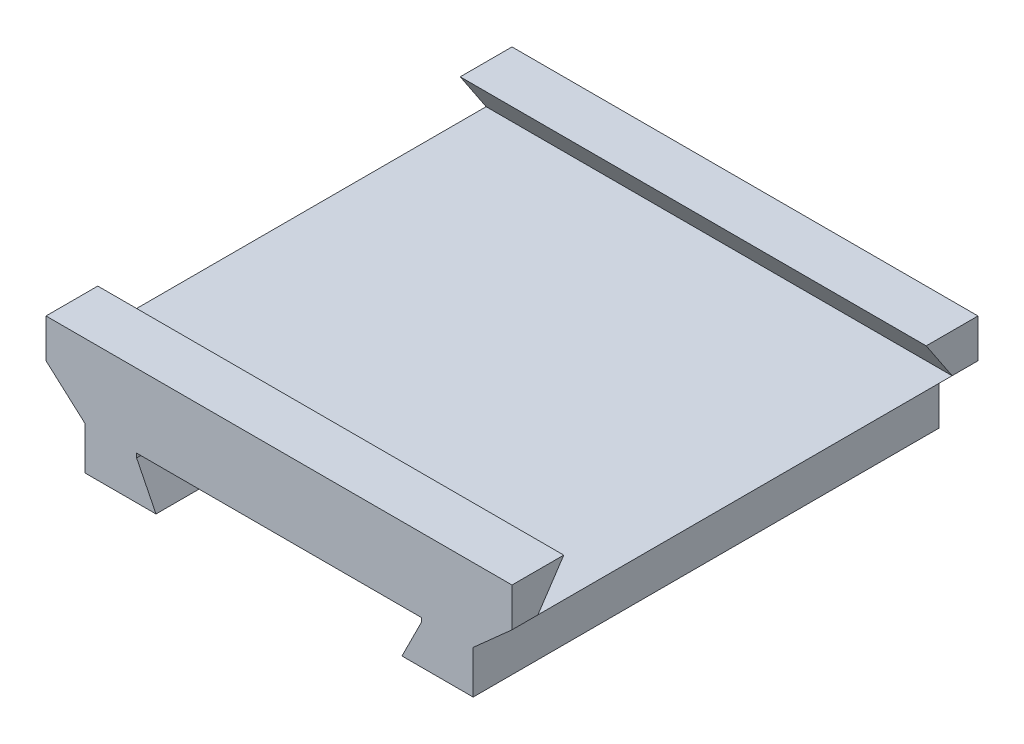
ISO-10303-21;
HEADER;
FILE_DESCRIPTION(('STEP AP214'),'2;1');
FILE_NAME('part.step','',(''),(''),'','','');
FILE_SCHEMA(('AUTOMOTIVE_DESIGN { 1 0 10303 214 1 1 1 1 }'));
ENDSEC;
DATA;
#1=APPLICATION_CONTEXT('core data for automotive mechanical design processes');
#2=APPLICATION_PROTOCOL_DEFINITION('international standard','automotive_design',2000,#1);
#3=PRODUCT_CONTEXT('',#1,'mechanical');
#4=PRODUCT('Part','Part','',(#3));
#5=PRODUCT_RELATED_PRODUCT_CATEGORY('part','',(#4));
#6=PRODUCT_DEFINITION_FORMATION('','',#4);
#7=PRODUCT_DEFINITION_CONTEXT('part definition',#1,'design');
#8=PRODUCT_DEFINITION('design','',#6,#7);
#9=PRODUCT_DEFINITION_SHAPE('','',#8);
#10=(LENGTH_UNIT() NAMED_UNIT(*) SI_UNIT(.MILLI.,.METRE.));
#11=(NAMED_UNIT(*) PLANE_ANGLE_UNIT() SI_UNIT($,.RADIAN.));
#12=(NAMED_UNIT(*) SI_UNIT($,.STERADIAN.) SOLID_ANGLE_UNIT());
#13=UNCERTAINTY_MEASURE_WITH_UNIT(LENGTH_MEASURE(1.E-05),#10,'distance_accuracy_value','');
#14=(GEOMETRIC_REPRESENTATION_CONTEXT(3) GLOBAL_UNCERTAINTY_ASSIGNED_CONTEXT((#13)) GLOBAL_UNIT_ASSIGNED_CONTEXT((#10,
#11,#12)) REPRESENTATION_CONTEXT('',''));
#15=CARTESIAN_POINT('',(0.,0.,0.));
#16=DIRECTION('',(0.,0.,1.));
#17=DIRECTION('',(1.,0.,0.));
#18=AXIS2_PLACEMENT_3D('',#15,#16,#17);
#19=CARTESIAN_POINT('',(90.,-31.,90.));
#20=DIRECTION('',(-1.,0.,0.));
#21=DIRECTION('',(0.,0.,1.));
#22=AXIS2_PLACEMENT_3D('',#19,#20,#21);
#23=PLANE('',#22);
#24=DIRECTION('',(0.,0.,-1.));
#25=VECTOR('',#24,1.);
#26=CARTESIAN_POINT('',(90.,-31.,90.));
#27=LINE('',#26,#25);
#28=CARTESIAN_POINT('',(90.,-31.,-70.));
#29=VERTEX_POINT('',#28);
#30=CARTESIAN_POINT('',(90.,-31.,-90.));
#31=VERTEX_POINT('',#30);
#32=EDGE_CURVE('E222',#29,#31,#27,.T.);
#33=ORIENTED_EDGE('',*,*,#32,.F.);
#34=DIRECTION('',(0.,0.832050294337843,0.55470019622523));
#35=VECTOR('',#34,1.);
#36=CARTESIAN_POINT('',(90.,-46.,-80.));
#37=LINE('',#36,#35);
#38=CARTESIAN_POINT('',(90.,-46.,-80.));
#39=VERTEX_POINT('',#38);
#40=EDGE_CURVE('E310',#39,#29,#37,.T.);
#41=ORIENTED_EDGE('',*,*,#40,.F.);
#42=DIRECTION('',(0.,0.,-1.));
#43=VECTOR('',#42,1.);
#44=CARTESIAN_POINT('',(90.,-46.,90.));
#45=LINE('',#44,#43);
#46=CARTESIAN_POINT('',(90.,-46.,-90.));
#47=VERTEX_POINT('',#46);
#48=EDGE_CURVE('E226',#39,#47,#45,.T.);
#49=ORIENTED_EDGE('',*,*,#48,.T.);
#50=DIRECTION('',(0.,1.,0.));
#51=VECTOR('',#50,1.);
#52=CARTESIAN_POINT('',(90.,-31.,-90.));
#53=LINE('',#52,#51);
#54=EDGE_CURVE('E195',#47,#31,#53,.T.);
#55=ORIENTED_EDGE('',*,*,#54,.T.);
#56=EDGE_LOOP('',(#33,#41,#49,#55));
#57=FACE_BOUND('',#56,.T.);
#58=ADVANCED_FACE('F33',(#57),#23,.F.);
#59=CARTESIAN_POINT('',(-90.,-31.,90.));
#60=DIRECTION('',(0.,-1.,0.));
#61=DIRECTION('',(1.,0.,0.));
#62=AXIS2_PLACEMENT_3D('',#59,#60,#61);
#63=PLANE('',#62);
#64=DIRECTION('',(0.,0.,-1.));
#65=VECTOR('',#64,1.);
#66=CARTESIAN_POINT('',(-90.,-31.,90.));
#67=LINE('',#66,#65);
#68=CARTESIAN_POINT('',(-90.,-31.,-70.));
#69=VERTEX_POINT('',#68);
#70=CARTESIAN_POINT('',(-90.,-31.,-90.));
#71=VERTEX_POINT('',#70);
#72=EDGE_CURVE('E218',#69,#71,#67,.T.);
#73=ORIENTED_EDGE('',*,*,#72,.F.);
#74=DIRECTION('',(1.,0.,0.));
#75=VECTOR('',#74,1.);
#76=CARTESIAN_POINT('',(-90.,-31.,-70.));
#77=LINE('',#76,#75);
#78=EDGE_CURVE('E182',#69,#29,#77,.T.);
#79=ORIENTED_EDGE('',*,*,#78,.T.);
#80=ORIENTED_EDGE('',*,*,#32,.T.);
#81=DIRECTION('',(-1.,0.,0.));
#82=VECTOR('',#81,1.);
#83=CARTESIAN_POINT('',(-90.,-31.,-90.));
#84=LINE('',#83,#82);
#85=EDGE_CURVE('E198',#31,#71,#84,.T.);
#86=ORIENTED_EDGE('',*,*,#85,.T.);
#87=EDGE_LOOP('',(#73,#79,#80,#86));
#88=FACE_BOUND('',#87,.T.);
#89=ADVANCED_FACE('F344',(#88),#63,.F.);
#90=CARTESIAN_POINT('',(-90.,-46.,90.));
#91=DIRECTION('',(1.,0.,0.));
#92=DIRECTION('',(0.,0.,-1.));
#93=AXIS2_PLACEMENT_3D('',#90,#91,#92);
#94=PLANE('',#93);
#95=DIRECTION('',(0.,0.,-1.));
#96=VECTOR('',#95,1.);
#97=CARTESIAN_POINT('',(-90.,-46.,90.));
#98=LINE('',#97,#96);
#99=CARTESIAN_POINT('',(-90.,-46.,-80.));
#100=VERTEX_POINT('',#99);
#101=CARTESIAN_POINT('',(-90.,-46.,-90.));
#102=VERTEX_POINT('',#101);
#103=EDGE_CURVE('E214',#100,#102,#98,.T.);
#104=ORIENTED_EDGE('',*,*,#103,.F.);
#105=DIRECTION('',(0.,0.832050294337843,0.55470019622523));
#106=VECTOR('',#105,1.);
#107=CARTESIAN_POINT('',(-90.,-46.,-80.));
#108=LINE('',#107,#106);
#109=EDGE_CURVE('E48',#100,#69,#108,.T.);
#110=ORIENTED_EDGE('',*,*,#109,.T.);
#111=ORIENTED_EDGE('',*,*,#72,.T.);
#112=DIRECTION('',(0.,-1.,0.));
#113=VECTOR('',#112,1.);
#114=CARTESIAN_POINT('',(-90.,-46.,-90.));
#115=LINE('',#114,#113);
#116=EDGE_CURVE('E201',#71,#102,#115,.T.);
#117=ORIENTED_EDGE('',*,*,#116,.T.);
#118=EDGE_LOOP('',(#104,#110,#111,#117));
#119=FACE_BOUND('',#118,.T.);
#120=ADVANCED_FACE('F349',(#119),#94,.F.);
#121=CARTESIAN_POINT('',(-55.,-61.,90.));
#122=DIRECTION('',(-1.,0.,0.));
#123=DIRECTION('',(0.,0.,1.));
#124=AXIS2_PLACEMENT_3D('',#121,#122,#123);
#125=PLANE('',#124);
#126=DIRECTION('',(0.,1.,0.));
#127=VECTOR('',#126,1.);
#128=CARTESIAN_POINT('',(-55.,-61.,-90.));
#129=LINE('',#128,#127);
#130=CARTESIAN_POINT('',(-55.,-61.,-90.));
#131=VERTEX_POINT('',#130);
#132=CARTESIAN_POINT('',(-55.,-59.37379199417,-90.));
#133=VERTEX_POINT('',#132);
#134=EDGE_CURVE('E178',#131,#133,#129,.T.);
#135=ORIENTED_EDGE('',*,*,#134,.T.);
#136=DIRECTION('',(0.,0.,-1.));
#137=VECTOR('',#136,1.);
#138=CARTESIAN_POINT('',(-55.,-59.37379199417,90.));
#139=LINE('',#138,#137);
#140=CARTESIAN_POINT('',(-55.,-59.37379199417,90.));
#141=VERTEX_POINT('',#140);
#142=EDGE_CURVE('E11',#141,#133,#139,.T.);
#143=ORIENTED_EDGE('',*,*,#142,.F.);
#144=DIRECTION('',(0.,1.,0.));
#145=VECTOR('',#144,1.);
#146=CARTESIAN_POINT('',(-55.,-61.,90.));
#147=LINE('',#146,#145);
#148=CARTESIAN_POINT('',(-55.,-61.,90.));
#149=VERTEX_POINT('',#148);
#150=EDGE_CURVE('E210',#149,#141,#147,.T.);
#151=ORIENTED_EDGE('',*,*,#150,.F.);
#152=DIRECTION('',(0.,0.,-1.));
#153=VECTOR('',#152,1.);
#154=CARTESIAN_POINT('',(-55.,-61.,90.));
#155=LINE('',#154,#153);
#156=EDGE_CURVE('E174',#149,#131,#155,.T.);
#157=ORIENTED_EDGE('',*,*,#156,.T.);
#158=EDGE_LOOP('',(#135,#143,#151,#157));
#159=FACE_BOUND('',#158,.T.);
#160=ADVANCED_FACE('F35',(#159),#125,.F.);
#161=CARTESIAN_POINT('',(-55.,-59.37379199417,90.));
#162=DIRECTION('',(0.,1.,0.));
#163=DIRECTION('',(0.,0.,1.));
#164=AXIS2_PLACEMENT_3D('',#161,#162,#163);
#165=PLANE('',#164);
#166=DIRECTION('',(1.,0.,0.));
#167=VECTOR('',#166,1.);
#168=CARTESIAN_POINT('',(-55.,-59.37379199417,-90.));
#169=LINE('',#168,#167);
#170=CARTESIAN_POINT('',(55.,-59.37379199417,-90.));
#171=VERTEX_POINT('',#170);
#172=EDGE_CURVE('E181',#133,#171,#169,.T.);
#173=ORIENTED_EDGE('',*,*,#172,.T.);
#174=DIRECTION('',(0.,0.,-1.));
#175=VECTOR('',#174,1.);
#176=CARTESIAN_POINT('',(55.,-59.37379199417,90.));
#177=LINE('',#176,#175);
#178=CARTESIAN_POINT('',(55.,-59.37379199417,90.));
#179=VERTEX_POINT('',#178);
#180=EDGE_CURVE('E41',#179,#171,#177,.T.);
#181=ORIENTED_EDGE('',*,*,#180,.F.);
#182=DIRECTION('',(1.,0.,0.));
#183=VECTOR('',#182,1.);
#184=CARTESIAN_POINT('',(-55.,-59.37379199417,90.));
#185=LINE('',#184,#183);
#186=EDGE_CURVE('E116',#141,#179,#185,.T.);
#187=ORIENTED_EDGE('',*,*,#186,.F.);
#188=ORIENTED_EDGE('',*,*,#142,.T.);
#189=EDGE_LOOP('',(#173,#181,#187,#188));
#190=FACE_BOUND('',#189,.T.);
#191=ADVANCED_FACE('F356',(#190),#165,.F.);
#192=CARTESIAN_POINT('',(55.,-59.37379199417,90.));
#193=DIRECTION('',(1.,0.,0.));
#194=DIRECTION('',(0.,0.,-1.));
#195=AXIS2_PLACEMENT_3D('',#192,#193,#194);
#196=PLANE('',#195);
#197=DIRECTION('',(0.,-1.,0.));
#198=VECTOR('',#197,1.);
#199=CARTESIAN_POINT('',(55.,-59.37379199417,-90.));
#200=LINE('',#199,#198);
#201=CARTESIAN_POINT('',(55.,-61.,-90.));
#202=VERTEX_POINT('',#201);
#203=EDGE_CURVE('E184',#171,#202,#200,.T.);
#204=ORIENTED_EDGE('',*,*,#203,.T.);
#205=DIRECTION('',(0.,0.,-1.));
#206=VECTOR('',#205,1.);
#207=CARTESIAN_POINT('',(55.,-61.,90.));
#208=LINE('',#207,#206);
#209=CARTESIAN_POINT('',(55.,-61.,90.));
#210=VERTEX_POINT('',#209);
#211=EDGE_CURVE('E239',#210,#202,#208,.T.);
#212=ORIENTED_EDGE('',*,*,#211,.F.);
#213=DIRECTION('',(0.,-1.,0.));
#214=VECTOR('',#213,1.);
#215=CARTESIAN_POINT('',(55.,-59.37379199417,90.));
#216=LINE('',#215,#214);
#217=EDGE_CURVE('E247',#179,#210,#216,.T.);
#218=ORIENTED_EDGE('',*,*,#217,.F.);
#219=ORIENTED_EDGE('',*,*,#180,.T.);
#220=EDGE_LOOP('',(#204,#212,#218,#219));
#221=FACE_BOUND('',#220,.T.);
#222=ADVANCED_FACE('F245',(#221),#196,.F.);
#223=CARTESIAN_POINT('',(47.5,-76.,90.));
#224=DIRECTION('',(0.894427190999916,-0.447213595499958,0.));
#225=DIRECTION('',(0.447213595499958,0.894427190999916,0.));
#226=AXIS2_PLACEMENT_3D('',#223,#224,#225);
#227=PLANE('',#226);
#228=DIRECTION('',(-0.447213595499958,-0.894427190999916,0.));
#229=VECTOR('',#228,1.);
#230=CARTESIAN_POINT('',(47.5,-76.,-90.));
#231=LINE('',#230,#229);
#232=CARTESIAN_POINT('',(47.5,-76.,-90.));
#233=VERTEX_POINT('',#232);
#234=EDGE_CURVE('E186',#202,#233,#231,.T.);
#235=ORIENTED_EDGE('',*,*,#234,.T.);
#236=DIRECTION('',(0.,0.,-1.));
#237=VECTOR('',#236,1.);
#238=CARTESIAN_POINT('',(47.5,-76.,90.));
#239=LINE('',#238,#237);
#240=CARTESIAN_POINT('',(47.5,-76.,90.));
#241=VERTEX_POINT('',#240);
#242=EDGE_CURVE('E236',#241,#233,#239,.T.);
#243=ORIENTED_EDGE('',*,*,#242,.F.);
#244=DIRECTION('',(-0.447213595499958,-0.894427190999916,0.));
#245=VECTOR('',#244,1.);
#246=CARTESIAN_POINT('',(47.5,-76.,90.));
#247=LINE('',#246,#245);
#248=EDGE_CURVE('E265',#210,#241,#247,.T.);
#249=ORIENTED_EDGE('',*,*,#248,.F.);
#250=ORIENTED_EDGE('',*,*,#211,.T.);
#251=EDGE_LOOP('',(#235,#243,#249,#250));
#252=FACE_BOUND('',#251,.T.);
#253=ADVANCED_FACE('F256',(#252),#227,.F.);
#254=CARTESIAN_POINT('',(75.,-76.,90.));
#255=DIRECTION('',(0.,1.,0.));
#256=DIRECTION('',(-1.,0.,0.));
#257=AXIS2_PLACEMENT_3D('',#254,#255,#256);
#258=PLANE('',#257);
#259=DIRECTION('',(1.,0.,0.));
#260=VECTOR('',#259,1.);
#261=CARTESIAN_POINT('',(75.,-76.,-90.));
#262=LINE('',#261,#260);
#263=CARTESIAN_POINT('',(75.,-76.,-90.));
#264=VERTEX_POINT('',#263);
#265=EDGE_CURVE('E188',#233,#264,#262,.T.);
#266=ORIENTED_EDGE('',*,*,#265,.T.);
#267=DIRECTION('',(0.,0.,-1.));
#268=VECTOR('',#267,1.);
#269=CARTESIAN_POINT('',(75.,-76.,90.));
#270=LINE('',#269,#268);
#271=CARTESIAN_POINT('',(75.,-76.,90.));
#272=VERTEX_POINT('',#271);
#273=EDGE_CURVE('E233',#272,#264,#270,.T.);
#274=ORIENTED_EDGE('',*,*,#273,.F.);
#275=DIRECTION('',(1.,0.,0.));
#276=VECTOR('',#275,1.);
#277=CARTESIAN_POINT('',(75.,-76.,90.));
#278=LINE('',#277,#276);
#279=EDGE_CURVE('E262',#241,#272,#278,.T.);
#280=ORIENTED_EDGE('',*,*,#279,.F.);
#281=ORIENTED_EDGE('',*,*,#242,.T.);
#282=EDGE_LOOP('',(#266,#274,#280,#281));
#283=FACE_BOUND('',#282,.T.);
#284=ADVANCED_FACE('F260',(#283),#258,.F.);
#285=CARTESIAN_POINT('',(75.,-59.37379199417,90.));
#286=DIRECTION('',(-1.,0.,0.));
#287=DIRECTION('',(0.,0.,1.));
#288=AXIS2_PLACEMENT_3D('',#285,#286,#287);
#289=PLANE('',#288);
#290=DIRECTION('',(0.,1.,0.));
#291=VECTOR('',#290,1.);
#292=CARTESIAN_POINT('',(75.,-59.37379199417,-90.));
#293=LINE('',#292,#291);
#294=CARTESIAN_POINT('',(75.,-59.37379199417,-90.));
#295=VERTEX_POINT('',#294);
#296=EDGE_CURVE('E190',#264,#295,#293,.T.);
#297=ORIENTED_EDGE('',*,*,#296,.T.);
#298=DIRECTION('',(0.,0.,-1.));
#299=VECTOR('',#298,1.);
#300=CARTESIAN_POINT('',(75.,-59.37379199417,90.));
#301=LINE('',#300,#299);
#302=CARTESIAN_POINT('',(75.,-59.37379199417,90.));
#303=VERTEX_POINT('',#302);
#304=EDGE_CURVE('E230',#303,#295,#301,.T.);
#305=ORIENTED_EDGE('',*,*,#304,.F.);
#306=DIRECTION('',(0.,1.,0.));
#307=VECTOR('',#306,1.);
#308=CARTESIAN_POINT('',(75.,-59.37379199417,90.));
#309=LINE('',#308,#307);
#310=EDGE_CURVE('E264',#272,#303,#309,.T.);
#311=ORIENTED_EDGE('',*,*,#310,.F.);
#312=ORIENTED_EDGE('',*,*,#273,.T.);
#313=EDGE_LOOP('',(#297,#305,#311,#312));
#314=FACE_BOUND('',#313,.T.);
#315=ADVANCED_FACE('F375',(#314),#289,.F.);
#316=CARTESIAN_POINT('',(90.,-46.,90.));
#317=DIRECTION('',(-0.665487727956286,0.746408791440441,0.));
#318=DIRECTION('',(-0.746408791440441,-0.665487727956286,0.));
#319=AXIS2_PLACEMENT_3D('',#316,#317,#318);
#320=PLANE('',#319);
#321=DIRECTION('',(0.746408791440441,0.665487727956286,0.));
#322=VECTOR('',#321,1.);
#323=CARTESIAN_POINT('',(90.,-46.,-90.));
#324=LINE('',#323,#322);
#325=EDGE_CURVE('E192',#295,#47,#324,.T.);
#326=ORIENTED_EDGE('',*,*,#325,.T.);
#327=ORIENTED_EDGE('',*,*,#48,.F.);
#328=DIRECTION('',(0.,0.,-1.));
#329=VECTOR('',#328,1.);
#330=CARTESIAN_POINT('',(90.,-46.,80.));
#331=LINE('',#330,#329);
#332=CARTESIAN_POINT('',(90.,-46.,80.));
#333=VERTEX_POINT('',#332);
#334=EDGE_CURVE('E313',#333,#39,#331,.T.);
#335=ORIENTED_EDGE('',*,*,#334,.F.);
#336=CARTESIAN_POINT('',(90.,-46.,90.));
#337=VERTEX_POINT('',#336);
#338=EDGE_CURVE('E227',#337,#333,#45,.T.);
#339=ORIENTED_EDGE('',*,*,#338,.F.);
#340=DIRECTION('',(0.746408791440441,0.665487727956286,0.));
#341=VECTOR('',#340,1.);
#342=CARTESIAN_POINT('',(90.,-46.,90.));
#343=LINE('',#342,#341);
#344=EDGE_CURVE('E267',#303,#337,#343,.T.);
#345=ORIENTED_EDGE('',*,*,#344,.F.);
#346=ORIENTED_EDGE('',*,*,#304,.T.);
#347=EDGE_LOOP('',(#326,#327,#335,#339,#345,#346));
#348=FACE_BOUND('',#347,.T.);
#349=ADVANCED_FACE('F368',(#348),#320,.F.);
#350=ORIENTED_EDGE('',*,*,#338,.T.);
#351=DIRECTION('',(0.,-0.832050294337843,0.554700196225229));
#352=VECTOR('',#351,1.);
#353=CARTESIAN_POINT('',(90.,-31.,70.));
#354=LINE('',#353,#352);
#355=CARTESIAN_POINT('',(90.,-31.,70.));
#356=VERTEX_POINT('',#355);
#357=EDGE_CURVE('E316',#356,#333,#354,.T.);
#358=ORIENTED_EDGE('',*,*,#357,.F.);
#359=CARTESIAN_POINT('',(90.,-31.,90.));
#360=VERTEX_POINT('',#359);
#361=EDGE_CURVE('E223',#360,#356,#27,.T.);
#362=ORIENTED_EDGE('',*,*,#361,.F.);
#363=DIRECTION('',(0.,1.,0.));
#364=VECTOR('',#363,1.);
#365=CARTESIAN_POINT('',(90.,-31.,90.));
#366=LINE('',#365,#364);
#367=EDGE_CURVE('E273',#337,#360,#366,.T.);
#368=ORIENTED_EDGE('',*,*,#367,.F.);
#369=EDGE_LOOP('',(#350,#358,#362,#368));
#370=FACE_BOUND('',#369,.T.);
#371=ADVANCED_FACE('F363',(#370),#23,.F.);
#372=ORIENTED_EDGE('',*,*,#361,.T.);
#373=DIRECTION('',(1.,0.,0.));
#374=VECTOR('',#373,1.);
#375=CARTESIAN_POINT('',(-90.,-31.,70.));
#376=LINE('',#375,#374);
#377=CARTESIAN_POINT('',(-90.,-31.,70.));
#378=VERTEX_POINT('',#377);
#379=EDGE_CURVE('E300',#378,#356,#376,.T.);
#380=ORIENTED_EDGE('',*,*,#379,.F.);
#381=CARTESIAN_POINT('',(-90.,-31.,90.));
#382=VERTEX_POINT('',#381);
#383=EDGE_CURVE('E219',#382,#378,#67,.T.);
#384=ORIENTED_EDGE('',*,*,#383,.F.);
#385=DIRECTION('',(-1.,0.,0.));
#386=VECTOR('',#385,1.);
#387=CARTESIAN_POINT('',(-90.,-31.,90.));
#388=LINE('',#387,#386);
#389=EDGE_CURVE('E275',#360,#382,#388,.T.);
#390=ORIENTED_EDGE('',*,*,#389,.F.);
#391=EDGE_LOOP('',(#372,#380,#384,#390));
#392=FACE_BOUND('',#391,.T.);
#393=ADVANCED_FACE('F358',(#392),#63,.F.);
#394=ORIENTED_EDGE('',*,*,#383,.T.);
#395=DIRECTION('',(0.,-0.832050294337843,0.554700196225229));
#396=VECTOR('',#395,1.);
#397=CARTESIAN_POINT('',(-90.,-31.,70.));
#398=LINE('',#397,#396);
#399=CARTESIAN_POINT('',(-90.,-46.,80.));
#400=VERTEX_POINT('',#399);
#401=EDGE_CURVE('E287',#378,#400,#398,.T.);
#402=ORIENTED_EDGE('',*,*,#401,.T.);
#403=CARTESIAN_POINT('',(-90.,-46.,90.));
#404=VERTEX_POINT('',#403);
#405=EDGE_CURVE('E215',#404,#400,#98,.T.);
#406=ORIENTED_EDGE('',*,*,#405,.F.);
#407=DIRECTION('',(0.,-1.,0.));
#408=VECTOR('',#407,1.);
#409=CARTESIAN_POINT('',(-90.,-46.,90.));
#410=LINE('',#409,#408);
#411=EDGE_CURVE('E277',#382,#404,#410,.T.);
#412=ORIENTED_EDGE('',*,*,#411,.F.);
#413=EDGE_LOOP('',(#394,#402,#406,#412));
#414=FACE_BOUND('',#413,.T.);
#415=ADVANCED_FACE('F284',(#414),#94,.F.);
#416=CARTESIAN_POINT('',(-75.,-59.37379199417,90.));
#417=DIRECTION('',(0.665487727956285,0.746408791440442,0.));
#418=DIRECTION('',(-0.746408791440442,0.665487727956285,0.));
#419=AXIS2_PLACEMENT_3D('',#416,#417,#418);
#420=PLANE('',#419);
#421=DIRECTION('',(0.746408791440442,-0.665487727956285,0.));
#422=VECTOR('',#421,1.);
#423=CARTESIAN_POINT('',(-75.,-59.37379199417,-90.));
#424=LINE('',#423,#422);
#425=CARTESIAN_POINT('',(-75.,-59.37379199417,-90.));
#426=VERTEX_POINT('',#425);
#427=EDGE_CURVE('E204',#102,#426,#424,.T.);
#428=ORIENTED_EDGE('',*,*,#427,.T.);
#429=DIRECTION('',(0.,0.,-1.));
#430=VECTOR('',#429,1.);
#431=CARTESIAN_POINT('',(-75.,-59.37379199417,90.));
#432=LINE('',#431,#430);
#433=CARTESIAN_POINT('',(-75.,-59.37379199417,90.));
#434=VERTEX_POINT('',#433);
#435=EDGE_CURVE('E169',#434,#426,#432,.T.);
#436=ORIENTED_EDGE('',*,*,#435,.F.);
#437=DIRECTION('',(0.746408791440442,-0.665487727956285,0.));
#438=VECTOR('',#437,1.);
#439=CARTESIAN_POINT('',(-75.,-59.37379199417,90.));
#440=LINE('',#439,#438);
#441=EDGE_CURVE('E157',#404,#434,#440,.T.);
#442=ORIENTED_EDGE('',*,*,#441,.F.);
#443=ORIENTED_EDGE('',*,*,#405,.T.);
#444=DIRECTION('',(0.,0.,-1.));
#445=VECTOR('',#444,1.);
#446=CARTESIAN_POINT('',(-90.,-46.,80.));
#447=LINE('',#446,#445);
#448=EDGE_CURVE('E320',#400,#100,#447,.T.);
#449=ORIENTED_EDGE('',*,*,#448,.T.);
#450=ORIENTED_EDGE('',*,*,#103,.T.);
#451=EDGE_LOOP('',(#428,#436,#442,#443,#449,#450));
#452=FACE_BOUND('',#451,.T.);
#453=ADVANCED_FACE('F290',(#452),#420,.F.);
#454=CARTESIAN_POINT('',(-75.,-76.,90.));
#455=DIRECTION('',(1.,0.,0.));
#456=DIRECTION('',(0.,0.,-1.));
#457=AXIS2_PLACEMENT_3D('',#454,#455,#456);
#458=PLANE('',#457);
#459=DIRECTION('',(0.,-1.,0.));
#460=VECTOR('',#459,1.);
#461=CARTESIAN_POINT('',(-75.,-76.,-90.));
#462=LINE('',#461,#460);
#463=CARTESIAN_POINT('',(-75.,-76.,-90.));
#464=VERTEX_POINT('',#463);
#465=EDGE_CURVE('E166',#426,#464,#462,.T.);
#466=ORIENTED_EDGE('',*,*,#465,.T.);
#467=DIRECTION('',(0.,0.,-1.));
#468=VECTOR('',#467,1.);
#469=CARTESIAN_POINT('',(-75.,-76.,90.));
#470=LINE('',#469,#468);
#471=CARTESIAN_POINT('',(-75.,-76.,90.));
#472=VERTEX_POINT('',#471);
#473=EDGE_CURVE('E163',#472,#464,#470,.T.);
#474=ORIENTED_EDGE('',*,*,#473,.F.);
#475=DIRECTION('',(0.,-1.,0.));
#476=VECTOR('',#475,1.);
#477=CARTESIAN_POINT('',(-75.,-76.,90.));
#478=LINE('',#477,#476);
#479=EDGE_CURVE('E150',#434,#472,#478,.T.);
#480=ORIENTED_EDGE('',*,*,#479,.F.);
#481=ORIENTED_EDGE('',*,*,#435,.T.);
#482=EDGE_LOOP('',(#466,#474,#480,#481));
#483=FACE_BOUND('',#482,.T.);
#484=ADVANCED_FACE('F164',(#483),#458,.F.);
#485=CARTESIAN_POINT('',(-47.5,-76.,90.));
#486=DIRECTION('',(0.,1.,0.));
#487=DIRECTION('',(-1.,0.,0.));
#488=AXIS2_PLACEMENT_3D('',#485,#486,#487);
#489=PLANE('',#488);
#490=DIRECTION('',(1.,0.,0.));
#491=VECTOR('',#490,1.);
#492=CARTESIAN_POINT('',(-47.5,-76.,-90.));
#493=LINE('',#492,#491);
#494=CARTESIAN_POINT('',(-47.5,-76.,-90.));
#495=VERTEX_POINT('',#494);
#496=EDGE_CURVE('E207',#464,#495,#493,.T.);
#497=ORIENTED_EDGE('',*,*,#496,.T.);
#498=DIRECTION('',(0.,0.,-1.));
#499=VECTOR('',#498,1.);
#500=CARTESIAN_POINT('',(-47.5,-76.,90.));
#501=LINE('',#500,#499);
#502=CARTESIAN_POINT('',(-47.5,-76.,90.));
#503=VERTEX_POINT('',#502);
#504=EDGE_CURVE('E170',#503,#495,#501,.T.);
#505=ORIENTED_EDGE('',*,*,#504,.F.);
#506=DIRECTION('',(1.,0.,0.));
#507=VECTOR('',#506,1.);
#508=CARTESIAN_POINT('',(-47.5,-76.,90.));
#509=LINE('',#508,#507);
#510=EDGE_CURVE('E154',#472,#503,#509,.T.);
#511=ORIENTED_EDGE('',*,*,#510,.F.);
#512=ORIENTED_EDGE('',*,*,#473,.T.);
#513=EDGE_LOOP('',(#497,#505,#511,#512));
#514=FACE_BOUND('',#513,.T.);
#515=ADVANCED_FACE('F172',(#514),#489,.F.);
#516=CARTESIAN_POINT('',(-55.,-61.,90.));
#517=DIRECTION('',(-0.894427190999916,-0.447213595499958,0.));
#518=DIRECTION('',(0.447213595499958,-0.894427190999916,0.));
#519=AXIS2_PLACEMENT_3D('',#516,#517,#518);
#520=PLANE('',#519);
#521=DIRECTION('',(-0.447213595499958,0.894427190999916,0.));
#522=VECTOR('',#521,1.);
#523=CARTESIAN_POINT('',(-55.,-61.,-90.));
#524=LINE('',#523,#522);
#525=EDGE_CURVE('E108',#495,#131,#524,.T.);
#526=ORIENTED_EDGE('',*,*,#525,.T.);
#527=ORIENTED_EDGE('',*,*,#156,.F.);
#528=DIRECTION('',(-0.447213595499958,0.894427190999916,0.));
#529=VECTOR('',#528,1.);
#530=CARTESIAN_POINT('',(-55.,-61.,90.));
#531=LINE('',#530,#529);
#532=EDGE_CURVE('E57',#503,#149,#531,.T.);
#533=ORIENTED_EDGE('',*,*,#532,.F.);
#534=ORIENTED_EDGE('',*,*,#504,.T.);
#535=EDGE_LOOP('',(#526,#527,#533,#534));
#536=FACE_BOUND('',#535,.T.);
#537=ADVANCED_FACE('F293',(#536),#520,.F.);
#538=CARTESIAN_POINT('',(0.,0.,90.));
#539=DIRECTION('',(0.,0.,-1.));
#540=DIRECTION('',(-1.,0.,0.));
#541=AXIS2_PLACEMENT_3D('',#538,#539,#540);
#542=PLANE('',#541);
#543=ORIENTED_EDGE('',*,*,#150,.T.);
#544=ORIENTED_EDGE('',*,*,#186,.T.);
#545=ORIENTED_EDGE('',*,*,#217,.T.);
#546=ORIENTED_EDGE('',*,*,#248,.T.);
#547=ORIENTED_EDGE('',*,*,#279,.T.);
#548=ORIENTED_EDGE('',*,*,#310,.T.);
#549=ORIENTED_EDGE('',*,*,#344,.T.);
#550=ORIENTED_EDGE('',*,*,#367,.T.);
#551=ORIENTED_EDGE('',*,*,#389,.T.);
#552=ORIENTED_EDGE('',*,*,#411,.T.);
#553=ORIENTED_EDGE('',*,*,#441,.T.);
#554=ORIENTED_EDGE('',*,*,#479,.T.);
#555=ORIENTED_EDGE('',*,*,#510,.T.);
#556=ORIENTED_EDGE('',*,*,#532,.T.);
#557=EDGE_LOOP('',(#543,#544,#545,#546,#547,#548,#549,#550,#551,#552,#553,#554,#555,#556));
#558=FACE_BOUND('',#557,.T.);
#559=ADVANCED_FACE('F152',(#558),#542,.F.);
#560=CARTESIAN_POINT('',(0.,0.,-90.));
#561=DIRECTION('',(0.,0.,-1.));
#562=DIRECTION('',(-1.,0.,0.));
#563=AXIS2_PLACEMENT_3D('',#560,#561,#562);
#564=PLANE('',#563);
#565=ORIENTED_EDGE('',*,*,#134,.F.);
#566=ORIENTED_EDGE('',*,*,#525,.F.);
#567=ORIENTED_EDGE('',*,*,#496,.F.);
#568=ORIENTED_EDGE('',*,*,#465,.F.);
#569=ORIENTED_EDGE('',*,*,#427,.F.);
#570=ORIENTED_EDGE('',*,*,#116,.F.);
#571=ORIENTED_EDGE('',*,*,#85,.F.);
#572=ORIENTED_EDGE('',*,*,#54,.F.);
#573=ORIENTED_EDGE('',*,*,#325,.F.);
#574=ORIENTED_EDGE('',*,*,#296,.F.);
#575=ORIENTED_EDGE('',*,*,#265,.F.);
#576=ORIENTED_EDGE('',*,*,#234,.F.);
#577=ORIENTED_EDGE('',*,*,#203,.F.);
#578=ORIENTED_EDGE('',*,*,#172,.F.);
#579=EDGE_LOOP('',(#565,#566,#567,#568,#569,#570,#571,#572,#573,#574,#575,#576,#577,#578));
#580=FACE_BOUND('',#579,.T.);
#581=ADVANCED_FACE('F251',(#580),#564,.T.);
#582=CARTESIAN_POINT('',(-90.,-46.,-80.));
#583=DIRECTION('',(0.,0.55470019622523,-0.832050294337843));
#584=DIRECTION('',(0.,0.832050294337843,0.55470019622523));
#585=AXIS2_PLACEMENT_3D('',#582,#583,#584);
#586=PLANE('',#585);
#587=ORIENTED_EDGE('',*,*,#40,.T.);
#588=ORIENTED_EDGE('',*,*,#78,.F.);
#589=ORIENTED_EDGE('',*,*,#109,.F.);
#590=DIRECTION('',(1.,0.,0.));
#591=VECTOR('',#590,1.);
#592=CARTESIAN_POINT('',(-90.,-46.,-80.));
#593=LINE('',#592,#591);
#594=EDGE_CURVE('E306',#100,#39,#593,.T.);
#595=ORIENTED_EDGE('',*,*,#594,.T.);
#596=EDGE_LOOP('',(#587,#588,#589,#595));
#597=FACE_BOUND('',#596,.T.);
#598=ADVANCED_FACE('F338',(#597),#586,.F.);
#599=CARTESIAN_POINT('',(-90.,-46.,80.));
#600=DIRECTION('',(0.,-1.,0.));
#601=DIRECTION('',(0.,0.,-1.));
#602=AXIS2_PLACEMENT_3D('',#599,#600,#601);
#603=PLANE('',#602);
#604=ORIENTED_EDGE('',*,*,#334,.T.);
#605=ORIENTED_EDGE('',*,*,#594,.F.);
#606=ORIENTED_EDGE('',*,*,#448,.F.);
#607=DIRECTION('',(1.,0.,0.));
#608=VECTOR('',#607,1.);
#609=CARTESIAN_POINT('',(-90.,-46.,80.));
#610=LINE('',#609,#608);
#611=EDGE_CURVE('E303',#400,#333,#610,.T.);
#612=ORIENTED_EDGE('',*,*,#611,.T.);
#613=EDGE_LOOP('',(#604,#605,#606,#612));
#614=FACE_BOUND('',#613,.T.);
#615=ADVANCED_FACE('F325',(#614),#603,.F.);
#616=CARTESIAN_POINT('',(-90.,-31.,70.));
#617=DIRECTION('',(0.,0.554700196225229,0.832050294337843));
#618=DIRECTION('',(0.,-0.832050294337843,0.554700196225229));
#619=AXIS2_PLACEMENT_3D('',#616,#617,#618);
#620=PLANE('',#619);
#621=ORIENTED_EDGE('',*,*,#357,.T.);
#622=ORIENTED_EDGE('',*,*,#611,.F.);
#623=ORIENTED_EDGE('',*,*,#401,.F.);
#624=ORIENTED_EDGE('',*,*,#379,.T.);
#625=EDGE_LOOP('',(#621,#622,#623,#624));
#626=FACE_BOUND('',#625,.T.);
#627=ADVANCED_FACE('F386',(#626),#620,.F.);
#628=CLOSED_SHELL('',(#58,#89,#120,#160,#191,#222,#253,#284,#315,#349,#371,#393,#415,#453,#484,
#515,#537,#559,#581,#598,#615,#627));
#629=MANIFOLD_SOLID_BREP('B2',#628);
#630=ADVANCED_BREP_SHAPE_REPRESENTATION('',(#18,#629),#14);
#631=SHAPE_DEFINITION_REPRESENTATION(#9,#630);
ENDSEC;
END-ISO-10303-21;
